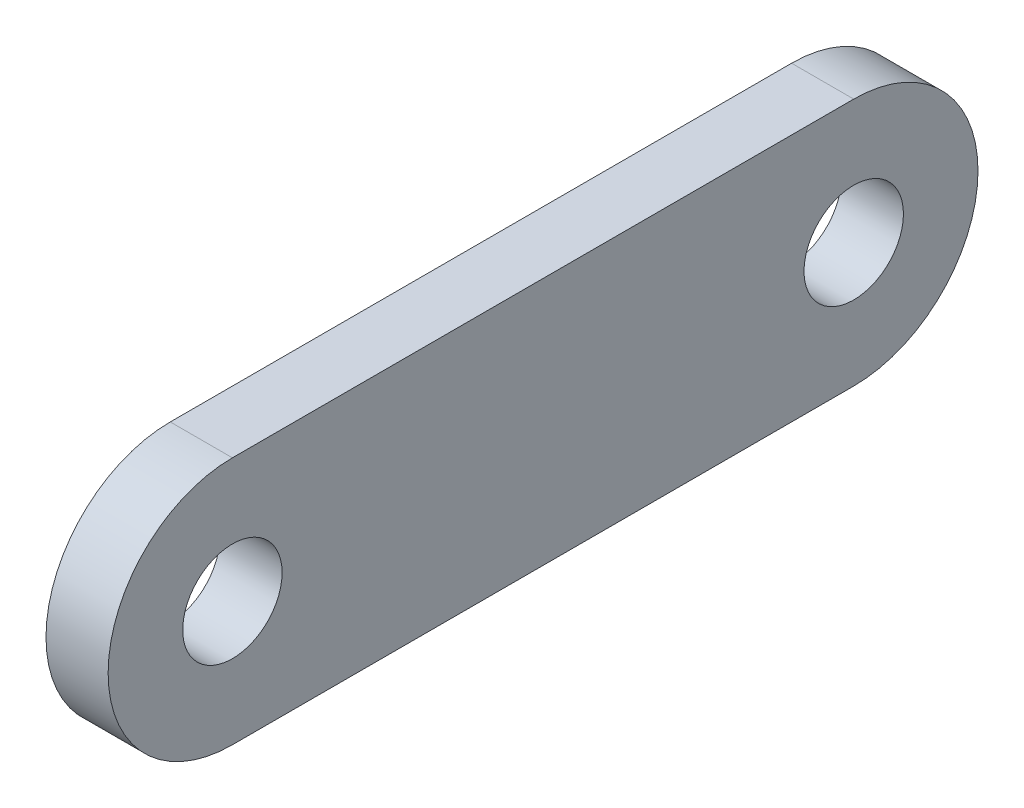
ISO-10303-21;
HEADER;
FILE_DESCRIPTION(('STEP AP214'),'2;1');
FILE_NAME('part.step','',(''),(''),'','','');
FILE_SCHEMA(('AUTOMOTIVE_DESIGN { 1 0 10303 214 1 1 1 1 }'));
ENDSEC;
DATA;
#1=APPLICATION_CONTEXT('core data for automotive mechanical design processes');
#2=APPLICATION_PROTOCOL_DEFINITION('international standard','automotive_design',2000,#1);
#3=PRODUCT_CONTEXT('',#1,'mechanical');
#4=PRODUCT('Part','Part','',(#3));
#5=PRODUCT_RELATED_PRODUCT_CATEGORY('part','',(#4));
#6=PRODUCT_DEFINITION_FORMATION('','',#4);
#7=PRODUCT_DEFINITION_CONTEXT('part definition',#1,'design');
#8=PRODUCT_DEFINITION('design','',#6,#7);
#9=PRODUCT_DEFINITION_SHAPE('','',#8);
#10=(LENGTH_UNIT() NAMED_UNIT(*) SI_UNIT(.MILLI.,.METRE.));
#11=(NAMED_UNIT(*) PLANE_ANGLE_UNIT() SI_UNIT($,.RADIAN.));
#12=(NAMED_UNIT(*) SI_UNIT($,.STERADIAN.) SOLID_ANGLE_UNIT());
#13=UNCERTAINTY_MEASURE_WITH_UNIT(LENGTH_MEASURE(1.E-05),#10,'distance_accuracy_value','');
#14=(GEOMETRIC_REPRESENTATION_CONTEXT(3) GLOBAL_UNCERTAINTY_ASSIGNED_CONTEXT((#13)) GLOBAL_UNIT_ASSIGNED_CONTEXT((#10,
#11,#12)) REPRESENTATION_CONTEXT('',''));
#15=CARTESIAN_POINT('',(0.,0.,0.));
#16=DIRECTION('',(0.,0.,1.));
#17=DIRECTION('',(1.,0.,0.));
#18=AXIS2_PLACEMENT_3D('',#15,#16,#17);
#19=CARTESIAN_POINT('',(5.,0.,25.));
#20=DIRECTION('',(-1.,0.,0.));
#21=DIRECTION('',(0.,0.,1.));
#22=AXIS2_PLACEMENT_3D('',#19,#20,#21);
#23=CYLINDRICAL_SURFACE('',#22,10.);
#24=CARTESIAN_POINT('',(0.,0.,25.));
#25=DIRECTION('',(1.,0.,0.));
#26=DIRECTION('',(0.,0.,-1.));
#27=AXIS2_PLACEMENT_3D('',#24,#25,#26);
#28=CIRCLE('',#27,10.);
#29=CARTESIAN_POINT('',(0.,10.,25.));
#30=VERTEX_POINT('',#29);
#31=CARTESIAN_POINT('',(0.,-10.,25.));
#32=VERTEX_POINT('',#31);
#33=EDGE_CURVE('E97',#30,#32,#28,.T.);
#34=ORIENTED_EDGE('',*,*,#33,.T.);
#35=DIRECTION('',(-1.,0.,0.));
#36=VECTOR('',#35,1.);
#37=CARTESIAN_POINT('',(5.,-10.,25.));
#38=LINE('',#37,#36);
#39=CARTESIAN_POINT('',(5.,-10.,25.));
#40=VERTEX_POINT('',#39);
#41=EDGE_CURVE('E11',#40,#32,#38,.T.);
#42=ORIENTED_EDGE('',*,*,#41,.F.);
#43=CARTESIAN_POINT('',(5.,0.,25.));
#44=DIRECTION('',(1.,0.,0.));
#45=DIRECTION('',(0.,0.,-1.));
#46=AXIS2_PLACEMENT_3D('',#43,#44,#45);
#47=CIRCLE('',#46,10.);
#48=CARTESIAN_POINT('',(5.,10.,25.));
#49=VERTEX_POINT('',#48);
#50=EDGE_CURVE('E85',#49,#40,#47,.T.);
#51=ORIENTED_EDGE('',*,*,#50,.F.);
#52=DIRECTION('',(-1.,0.,0.));
#53=VECTOR('',#52,1.);
#54=CARTESIAN_POINT('',(5.,10.,25.));
#55=LINE('',#54,#53);
#56=EDGE_CURVE('E93',#49,#30,#55,.T.);
#57=ORIENTED_EDGE('',*,*,#56,.T.);
#58=EDGE_LOOP('',(#34,#42,#51,#57));
#59=FACE_BOUND('',#58,.T.);
#60=ADVANCED_FACE('F34',(#59),#23,.T.);
#61=CARTESIAN_POINT('',(5.,-10.,25.));
#62=DIRECTION('',(0.,1.,0.));
#63=DIRECTION('',(0.,0.,1.));
#64=AXIS2_PLACEMENT_3D('',#61,#62,#63);
#65=PLANE('',#64);
#66=DIRECTION('',(0.,0.,-1.));
#67=VECTOR('',#66,1.);
#68=CARTESIAN_POINT('',(0.,-10.,25.));
#69=LINE('',#68,#67);
#70=CARTESIAN_POINT('',(0.,-9.99999999999999,-25.));
#71=VERTEX_POINT('',#70);
#72=EDGE_CURVE('E89',#32,#71,#69,.T.);
#73=ORIENTED_EDGE('',*,*,#72,.T.);
#74=DIRECTION('',(-1.,0.,0.));
#75=VECTOR('',#74,1.);
#76=CARTESIAN_POINT('',(5.,-9.99999999999999,-25.));
#77=LINE('',#76,#75);
#78=CARTESIAN_POINT('',(5.,-9.99999999999999,-25.));
#79=VERTEX_POINT('',#78);
#80=EDGE_CURVE('E42',#79,#71,#77,.T.);
#81=ORIENTED_EDGE('',*,*,#80,.F.);
#82=DIRECTION('',(0.,0.,-1.));
#83=VECTOR('',#82,1.);
#84=CARTESIAN_POINT('',(5.,-10.,25.));
#85=LINE('',#84,#83);
#86=EDGE_CURVE('E80',#40,#79,#85,.T.);
#87=ORIENTED_EDGE('',*,*,#86,.F.);
#88=ORIENTED_EDGE('',*,*,#41,.T.);
#89=EDGE_LOOP('',(#73,#81,#87,#88));
#90=FACE_BOUND('',#89,.T.);
#91=ADVANCED_FACE('F88',(#90),#65,.F.);
#92=CARTESIAN_POINT('',(5.,0.,-25.));
#93=DIRECTION('',(-1.,0.,0.));
#94=DIRECTION('',(0.,0.,1.));
#95=AXIS2_PLACEMENT_3D('',#92,#93,#94);
#96=CYLINDRICAL_SURFACE('',#95,10.);
#97=CARTESIAN_POINT('',(0.,0.,-25.));
#98=DIRECTION('',(1.,0.,0.));
#99=DIRECTION('',(0.,0.,-1.));
#100=AXIS2_PLACEMENT_3D('',#97,#98,#99);
#101=CIRCLE('',#100,10.);
#102=CARTESIAN_POINT('',(0.,10.,-25.));
#103=VERTEX_POINT('',#102);
#104=EDGE_CURVE('E67',#71,#103,#101,.T.);
#105=ORIENTED_EDGE('',*,*,#104,.T.);
#106=DIRECTION('',(-1.,0.,0.));
#107=VECTOR('',#106,1.);
#108=CARTESIAN_POINT('',(5.,10.,-25.));
#109=LINE('',#108,#107);
#110=CARTESIAN_POINT('',(5.,10.,-25.));
#111=VERTEX_POINT('',#110);
#112=EDGE_CURVE('E90',#111,#103,#109,.T.);
#113=ORIENTED_EDGE('',*,*,#112,.F.);
#114=CARTESIAN_POINT('',(5.,0.,-25.));
#115=DIRECTION('',(1.,0.,0.));
#116=DIRECTION('',(0.,0.,-1.));
#117=AXIS2_PLACEMENT_3D('',#114,#115,#116);
#118=CIRCLE('',#117,10.);
#119=EDGE_CURVE('E83',#79,#111,#118,.T.);
#120=ORIENTED_EDGE('',*,*,#119,.F.);
#121=ORIENTED_EDGE('',*,*,#80,.T.);
#122=EDGE_LOOP('',(#105,#113,#120,#121));
#123=FACE_BOUND('',#122,.T.);
#124=ADVANCED_FACE('F91',(#123),#96,.T.);
#125=CARTESIAN_POINT('',(5.,10.,25.));
#126=DIRECTION('',(0.,-1.,0.));
#127=DIRECTION('',(0.,0.,-1.));
#128=AXIS2_PLACEMENT_3D('',#125,#126,#127);
#129=PLANE('',#128);
#130=DIRECTION('',(0.,0.,1.));
#131=VECTOR('',#130,1.);
#132=CARTESIAN_POINT('',(0.,10.,25.));
#133=LINE('',#132,#131);
#134=EDGE_CURVE('E73',#103,#30,#133,.T.);
#135=ORIENTED_EDGE('',*,*,#134,.T.);
#136=ORIENTED_EDGE('',*,*,#56,.F.);
#137=DIRECTION('',(0.,0.,1.));
#138=VECTOR('',#137,1.);
#139=CARTESIAN_POINT('',(5.,10.,25.));
#140=LINE('',#139,#138);
#141=EDGE_CURVE('E50',#111,#49,#140,.T.);
#142=ORIENTED_EDGE('',*,*,#141,.F.);
#143=ORIENTED_EDGE('',*,*,#112,.T.);
#144=EDGE_LOOP('',(#135,#136,#142,#143));
#145=FACE_BOUND('',#144,.T.);
#146=ADVANCED_FACE('F105',(#145),#129,.F.);
#147=CARTESIAN_POINT('',(5.,0.,25.));
#148=DIRECTION('',(1.,0.,0.));
#149=DIRECTION('',(0.,0.,-1.));
#150=AXIS2_PLACEMENT_3D('',#147,#148,#149);
#151=PLANE('',#150);
#152=CARTESIAN_POINT('',(5.,0.,-25.));
#153=DIRECTION('',(1.,0.,0.));
#154=DIRECTION('',(0.,0.,-1.));
#155=AXIS2_PLACEMENT_3D('',#152,#153,#154);
#156=CIRCLE('',#155,4.);
#157=CARTESIAN_POINT('',(5.,0.,-29.));
#158=VERTEX_POINT('',#157);
#159=EDGE_CURVE('E117',#158,#158,#156,.T.);
#160=ORIENTED_EDGE('',*,*,#159,.F.);
#161=EDGE_LOOP('',(#160));
#162=FACE_BOUND('',#161,.T.);
#163=CARTESIAN_POINT('',(5.,0.,25.));
#164=DIRECTION('',(1.,0.,0.));
#165=DIRECTION('',(0.,0.,-1.));
#166=AXIS2_PLACEMENT_3D('',#163,#164,#165);
#167=CIRCLE('',#166,4.);
#168=CARTESIAN_POINT('',(5.,0.,21.));
#169=VERTEX_POINT('',#168);
#170=EDGE_CURVE('E111',#169,#169,#167,.T.);
#171=ORIENTED_EDGE('',*,*,#170,.F.);
#172=EDGE_LOOP('',(#171));
#173=FACE_BOUND('',#172,.T.);
#174=ORIENTED_EDGE('',*,*,#50,.T.);
#175=ORIENTED_EDGE('',*,*,#86,.T.);
#176=ORIENTED_EDGE('',*,*,#119,.T.);
#177=ORIENTED_EDGE('',*,*,#141,.T.);
#178=EDGE_LOOP('',(#174,#175,#176,#177));
#179=FACE_BOUND('',#178,.T.);
#180=ADVANCED_FACE('F81',(#162,#173,#179),#151,.T.);
#181=CARTESIAN_POINT('',(0.,0.,25.));
#182=DIRECTION('',(1.,0.,0.));
#183=DIRECTION('',(0.,0.,-1.));
#184=AXIS2_PLACEMENT_3D('',#181,#182,#183);
#185=PLANE('',#184);
#186=CARTESIAN_POINT('',(0.,0.,-25.));
#187=DIRECTION('',(1.,0.,0.));
#188=DIRECTION('',(0.,0.,-1.));
#189=AXIS2_PLACEMENT_3D('',#186,#187,#188);
#190=CIRCLE('',#189,4.);
#191=CARTESIAN_POINT('',(0.,0.,-29.));
#192=VERTEX_POINT('',#191);
#193=EDGE_CURVE('E114',#192,#192,#190,.T.);
#194=ORIENTED_EDGE('',*,*,#193,.T.);
#195=EDGE_LOOP('',(#194));
#196=FACE_BOUND('',#195,.T.);
#197=CARTESIAN_POINT('',(0.,0.,25.));
#198=DIRECTION('',(1.,0.,0.));
#199=DIRECTION('',(0.,0.,-1.));
#200=AXIS2_PLACEMENT_3D('',#197,#198,#199);
#201=CIRCLE('',#200,4.);
#202=CARTESIAN_POINT('',(0.,0.,21.));
#203=VERTEX_POINT('',#202);
#204=EDGE_CURVE('E100',#203,#203,#201,.T.);
#205=ORIENTED_EDGE('',*,*,#204,.T.);
#206=EDGE_LOOP('',(#205));
#207=FACE_BOUND('',#206,.T.);
#208=ORIENTED_EDGE('',*,*,#33,.F.);
#209=ORIENTED_EDGE('',*,*,#134,.F.);
#210=ORIENTED_EDGE('',*,*,#104,.F.);
#211=ORIENTED_EDGE('',*,*,#72,.F.);
#212=EDGE_LOOP('',(#208,#209,#210,#211));
#213=FACE_BOUND('',#212,.T.);
#214=ADVANCED_FACE('F108',(#196,#207,#213),#185,.F.);
#215=CARTESIAN_POINT('',(0.,0.,25.));
#216=DIRECTION('',(1.,0.,0.));
#217=DIRECTION('',(0.,0.,-1.));
#218=AXIS2_PLACEMENT_3D('',#215,#216,#217);
#219=CYLINDRICAL_SURFACE('',#218,4.);
#220=ORIENTED_EDGE('',*,*,#204,.F.);
#221=EDGE_LOOP('',(#220));
#222=FACE_BOUND('',#221,.T.);
#223=ORIENTED_EDGE('',*,*,#170,.T.);
#224=EDGE_LOOP('',(#223));
#225=FACE_BOUND('',#224,.T.);
#226=ADVANCED_FACE('F128',(#222,#225),#219,.F.);
#227=CARTESIAN_POINT('',(0.,0.,-25.));
#228=DIRECTION('',(1.,0.,0.));
#229=DIRECTION('',(0.,0.,-1.));
#230=AXIS2_PLACEMENT_3D('',#227,#228,#229);
#231=CYLINDRICAL_SURFACE('',#230,4.);
#232=ORIENTED_EDGE('',*,*,#193,.F.);
#233=EDGE_LOOP('',(#232));
#234=FACE_BOUND('',#233,.T.);
#235=ORIENTED_EDGE('',*,*,#159,.T.);
#236=EDGE_LOOP('',(#235));
#237=FACE_BOUND('',#236,.T.);
#238=ADVANCED_FACE('F125',(#234,#237),#231,.F.);
#239=CLOSED_SHELL('',(#60,#91,#124,#146,#180,#214,#226,#238));
#240=MANIFOLD_SOLID_BREP('B2',#239);
#241=ADVANCED_BREP_SHAPE_REPRESENTATION('',(#18,#240),#14);
#242=SHAPE_DEFINITION_REPRESENTATION(#9,#241);
ENDSEC;
END-ISO-10303-21;
